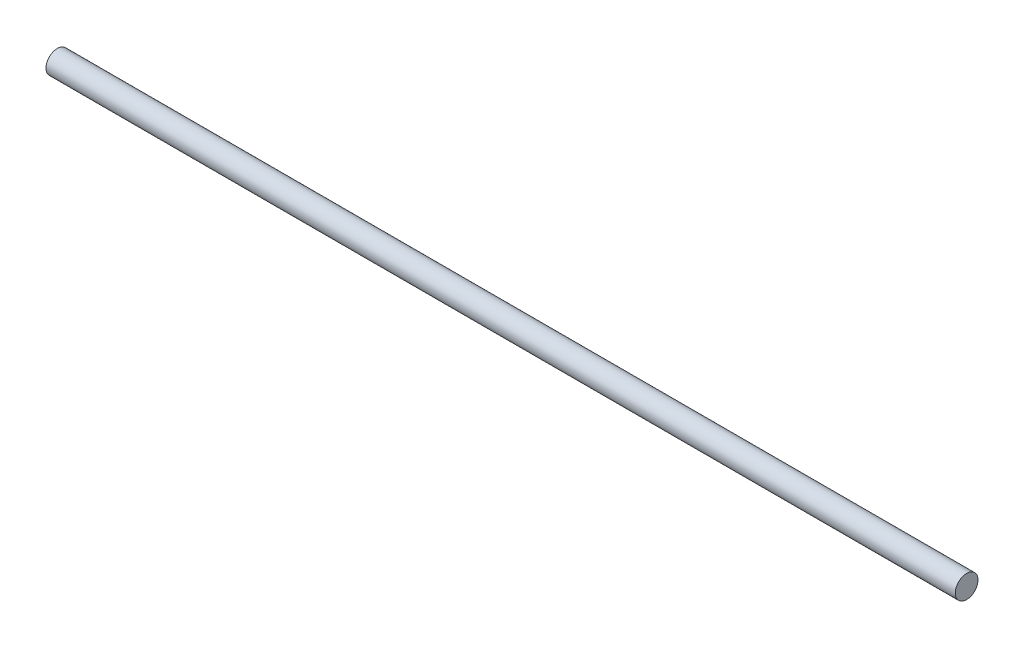
ISO-10303-21;
HEADER;
FILE_DESCRIPTION(('STEP AP214'),'2;1');
FILE_NAME('part.step','',(''),(''),'','','');
FILE_SCHEMA(('AUTOMOTIVE_DESIGN { 1 0 10303 214 1 1 1 1 }'));
ENDSEC;
DATA;
#1=APPLICATION_CONTEXT('core data for automotive mechanical design processes');
#2=APPLICATION_PROTOCOL_DEFINITION('international standard','automotive_design',2000,#1);
#3=PRODUCT_CONTEXT('',#1,'mechanical');
#4=PRODUCT('Part','Part','',(#3));
#5=PRODUCT_RELATED_PRODUCT_CATEGORY('part','',(#4));
#6=PRODUCT_DEFINITION_FORMATION('','',#4);
#7=PRODUCT_DEFINITION_CONTEXT('part definition',#1,'design');
#8=PRODUCT_DEFINITION('design','',#6,#7);
#9=PRODUCT_DEFINITION_SHAPE('','',#8);
#10=(LENGTH_UNIT() NAMED_UNIT(*) SI_UNIT(.MILLI.,.METRE.));
#11=(NAMED_UNIT(*) PLANE_ANGLE_UNIT() SI_UNIT($,.RADIAN.));
#12=(NAMED_UNIT(*) SI_UNIT($,.STERADIAN.) SOLID_ANGLE_UNIT());
#13=UNCERTAINTY_MEASURE_WITH_UNIT(LENGTH_MEASURE(1.E-05),#10,'distance_accuracy_value','');
#14=(GEOMETRIC_REPRESENTATION_CONTEXT(3) GLOBAL_UNCERTAINTY_ASSIGNED_CONTEXT((#13)) GLOBAL_UNIT_ASSIGNED_CONTEXT((#10,
#11,#12)) REPRESENTATION_CONTEXT('',''));
#15=CARTESIAN_POINT('',(0.,0.,0.));
#16=DIRECTION('',(0.,0.,1.));
#17=DIRECTION('',(1.,0.,0.));
#18=AXIS2_PLACEMENT_3D('',#15,#16,#17);
#19=CARTESIAN_POINT('',(508.,0.,0.));
#20=DIRECTION('',(-1.,0.,0.));
#21=DIRECTION('',(0.,0.,1.));
#22=AXIS2_PLACEMENT_3D('',#19,#20,#21);
#23=CYLINDRICAL_SURFACE('',#22,6.35);
#24=CARTESIAN_POINT('',(508.,0.,0.));
#25=DIRECTION('',(1.,0.,0.));
#26=DIRECTION('',(0.,0.,-1.));
#27=AXIS2_PLACEMENT_3D('',#24,#25,#26);
#28=CIRCLE('',#27,6.35);
#29=CARTESIAN_POINT('',(508.,0.,-6.35));
#30=VERTEX_POINT('',#29);
#31=EDGE_CURVE('E10',#30,#30,#28,.T.);
#32=ORIENTED_EDGE('',*,*,#31,.F.);
#33=EDGE_LOOP('',(#32));
#34=FACE_BOUND('',#33,.T.);
#35=CARTESIAN_POINT('',(0.,0.,0.));
#36=DIRECTION('',(1.,0.,0.));
#37=DIRECTION('',(0.,0.,-1.));
#38=AXIS2_PLACEMENT_3D('',#35,#36,#37);
#39=CIRCLE('',#38,6.35);
#40=CARTESIAN_POINT('',(0.,0.,-6.35));
#41=VERTEX_POINT('',#40);
#42=EDGE_CURVE('E33',#41,#41,#39,.T.);
#43=ORIENTED_EDGE('',*,*,#42,.T.);
#44=EDGE_LOOP('',(#43));
#45=FACE_BOUND('',#44,.T.);
#46=ADVANCED_FACE('F30',(#34,#45),#23,.T.);
#47=CARTESIAN_POINT('',(508.,0.,0.));
#48=DIRECTION('',(1.,0.,0.));
#49=DIRECTION('',(0.,0.,-1.));
#50=AXIS2_PLACEMENT_3D('',#47,#48,#49);
#51=PLANE('',#50);
#52=ORIENTED_EDGE('',*,*,#31,.T.);
#53=EDGE_LOOP('',(#52));
#54=FACE_BOUND('',#53,.T.);
#55=ADVANCED_FACE('F45',(#54),#51,.T.);
#56=CARTESIAN_POINT('',(0.,0.,0.));
#57=DIRECTION('',(1.,0.,0.));
#58=DIRECTION('',(0.,0.,-1.));
#59=AXIS2_PLACEMENT_3D('',#56,#57,#58);
#60=PLANE('',#59);
#61=ORIENTED_EDGE('',*,*,#42,.F.);
#62=EDGE_LOOP('',(#61));
#63=FACE_BOUND('',#62,.T.);
#64=ADVANCED_FACE('F43',(#63),#60,.F.);
#65=CLOSED_SHELL('',(#46,#55,#64));
#66=MANIFOLD_SOLID_BREP('B2',#65);
#67=ADVANCED_BREP_SHAPE_REPRESENTATION('',(#18,#66),#14);
#68=SHAPE_DEFINITION_REPRESENTATION(#9,#67);
ENDSEC;
END-ISO-10303-21;
